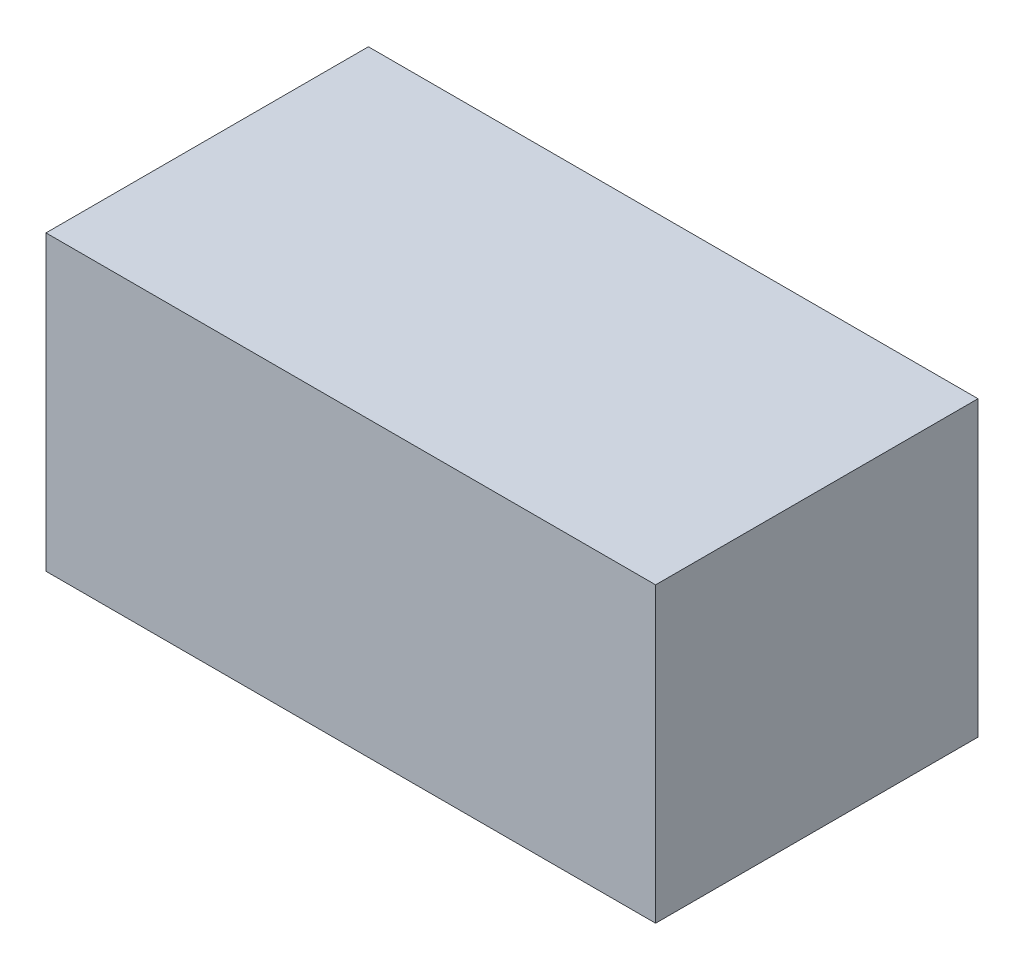
ISO-10303-21;
HEADER;
FILE_DESCRIPTION(('STEP AP214'),'2;1');
FILE_NAME('part.step','',(''),(''),'','','');
FILE_SCHEMA(('AUTOMOTIVE_DESIGN { 1 0 10303 214 1 1 1 1 }'));
ENDSEC;
DATA;
#1=APPLICATION_CONTEXT('core data for automotive mechanical design processes');
#2=APPLICATION_PROTOCOL_DEFINITION('international standard','automotive_design',2000,#1);
#3=PRODUCT_CONTEXT('',#1,'mechanical');
#4=PRODUCT('Part','Part','',(#3));
#5=PRODUCT_RELATED_PRODUCT_CATEGORY('part','',(#4));
#6=PRODUCT_DEFINITION_FORMATION('','',#4);
#7=PRODUCT_DEFINITION_CONTEXT('part definition',#1,'design');
#8=PRODUCT_DEFINITION('design','',#6,#7);
#9=PRODUCT_DEFINITION_SHAPE('','',#8);
#10=(LENGTH_UNIT() NAMED_UNIT(*) SI_UNIT(.MILLI.,.METRE.));
#11=(NAMED_UNIT(*) PLANE_ANGLE_UNIT() SI_UNIT($,.RADIAN.));
#12=(NAMED_UNIT(*) SI_UNIT($,.STERADIAN.) SOLID_ANGLE_UNIT());
#13=UNCERTAINTY_MEASURE_WITH_UNIT(LENGTH_MEASURE(1.E-05),#10,'distance_accuracy_value','');
#14=(GEOMETRIC_REPRESENTATION_CONTEXT(3) GLOBAL_UNCERTAINTY_ASSIGNED_CONTEXT((#13)) GLOBAL_UNIT_ASSIGNED_CONTEXT((#10,
#11,#12)) REPRESENTATION_CONTEXT('',''));
#15=CARTESIAN_POINT('',(0.,0.,0.));
#16=DIRECTION('',(0.,0.,1.));
#17=DIRECTION('',(1.,0.,0.));
#18=AXIS2_PLACEMENT_3D('',#15,#16,#17);
#19=CARTESIAN_POINT('',(8.128,-4.064,13.97));
#20=DIRECTION('',(0.,0.,-1.));
#21=DIRECTION('',(-1.,0.,0.));
#22=AXIS2_PLACEMENT_3D('',#19,#20,#21);
#23=PLANE('',#22);
#24=DIRECTION('',(0.,1.,0.));
#25=VECTOR('',#24,1.);
#26=CARTESIAN_POINT('',(-5.08,-10.414,13.97));
#27=LINE('',#26,#25);
#28=CARTESIAN_POINT('',(-5.08,-10.414,13.97));
#29=VERTEX_POINT('',#28);
#30=CARTESIAN_POINT('',(-5.08,2.286,13.97));
#31=VERTEX_POINT('',#30);
#32=EDGE_CURVE('E27',#29,#31,#27,.T.);
#33=ORIENTED_EDGE('',*,*,#32,.F.);
#34=DIRECTION('',(-1.,0.,0.));
#35=VECTOR('',#34,1.);
#36=CARTESIAN_POINT('',(21.336,-10.414,13.97));
#37=LINE('',#36,#35);
#38=CARTESIAN_POINT('',(21.336,-10.414,13.97));
#39=VERTEX_POINT('',#38);
#40=EDGE_CURVE('E63',#39,#29,#37,.T.);
#41=ORIENTED_EDGE('',*,*,#40,.F.);
#42=DIRECTION('',(0.,-1.,0.));
#43=VECTOR('',#42,1.);
#44=CARTESIAN_POINT('',(21.336,2.286,13.97));
#45=LINE('',#44,#43);
#46=CARTESIAN_POINT('',(21.336,2.286,13.97));
#47=VERTEX_POINT('',#46);
#48=EDGE_CURVE('E91',#47,#39,#45,.T.);
#49=ORIENTED_EDGE('',*,*,#48,.F.);
#50=DIRECTION('',(1.,0.,0.));
#51=VECTOR('',#50,1.);
#52=CARTESIAN_POINT('',(-5.08,2.286,13.97));
#53=LINE('',#52,#51);
#54=EDGE_CURVE('E107',#31,#47,#53,.T.);
#55=ORIENTED_EDGE('',*,*,#54,.F.);
#56=EDGE_LOOP('',(#33,#41,#49,#55));
#57=FACE_BOUND('',#56,.T.);
#58=ADVANCED_FACE('F16',(#57),#23,.F.);
#59=CARTESIAN_POINT('',(8.128,-4.064,0.));
#60=DIRECTION('',(0.,0.,-1.));
#61=DIRECTION('',(-1.,0.,0.));
#62=AXIS2_PLACEMENT_3D('',#59,#60,#61);
#63=PLANE('',#62);
#64=DIRECTION('',(1.,0.,0.));
#65=VECTOR('',#64,1.);
#66=CARTESIAN_POINT('',(-5.08,2.286,0.));
#67=LINE('',#66,#65);
#68=CARTESIAN_POINT('',(-5.08,2.286,0.));
#69=VERTEX_POINT('',#68);
#70=CARTESIAN_POINT('',(21.336,2.286,0.));
#71=VERTEX_POINT('',#70);
#72=EDGE_CURVE('E84',#69,#71,#67,.T.);
#73=ORIENTED_EDGE('',*,*,#72,.T.);
#74=DIRECTION('',(0.,-1.,0.));
#75=VECTOR('',#74,1.);
#76=CARTESIAN_POINT('',(21.336,2.286,0.));
#77=LINE('',#76,#75);
#78=CARTESIAN_POINT('',(21.336,-10.414,0.));
#79=VERTEX_POINT('',#78);
#80=EDGE_CURVE('E81',#71,#79,#77,.T.);
#81=ORIENTED_EDGE('',*,*,#80,.T.);
#82=DIRECTION('',(-1.,0.,0.));
#83=VECTOR('',#82,1.);
#84=CARTESIAN_POINT('',(21.336,-10.414,0.));
#85=LINE('',#84,#83);
#86=CARTESIAN_POINT('',(-5.08,-10.414,0.));
#87=VERTEX_POINT('',#86);
#88=EDGE_CURVE('E70',#79,#87,#85,.T.);
#89=ORIENTED_EDGE('',*,*,#88,.T.);
#90=DIRECTION('',(0.,1.,0.));
#91=VECTOR('',#90,1.);
#92=CARTESIAN_POINT('',(-5.08,-10.414,0.));
#93=LINE('',#92,#91);
#94=EDGE_CURVE('E11',#87,#69,#93,.T.);
#95=ORIENTED_EDGE('',*,*,#94,.T.);
#96=EDGE_LOOP('',(#73,#81,#89,#95));
#97=FACE_BOUND('',#96,.T.);
#98=ADVANCED_FACE('F82',(#97),#63,.T.);
#99=CARTESIAN_POINT('',(-5.08,-10.414,0.));
#100=DIRECTION('',(-1.,0.,0.));
#101=DIRECTION('',(0.,0.,1.));
#102=AXIS2_PLACEMENT_3D('',#99,#100,#101);
#103=PLANE('',#102);
#104=DIRECTION('',(0.,0.,1.));
#105=VECTOR('',#104,1.);
#106=CARTESIAN_POINT('',(-5.08,-10.414,0.));
#107=LINE('',#106,#105);
#108=EDGE_CURVE('E76',#87,#29,#107,.T.);
#109=ORIENTED_EDGE('',*,*,#108,.T.);
#110=ORIENTED_EDGE('',*,*,#32,.T.);
#111=DIRECTION('',(0.,0.,1.));
#112=VECTOR('',#111,1.);
#113=CARTESIAN_POINT('',(-5.08,2.286,0.));
#114=LINE('',#113,#112);
#115=EDGE_CURVE('E20',#69,#31,#114,.T.);
#116=ORIENTED_EDGE('',*,*,#115,.F.);
#117=ORIENTED_EDGE('',*,*,#94,.F.);
#118=EDGE_LOOP('',(#109,#110,#116,#117));
#119=FACE_BOUND('',#118,.T.);
#120=ADVANCED_FACE('F121',(#119),#103,.T.);
#121=CARTESIAN_POINT('',(21.336,-10.414,0.));
#122=DIRECTION('',(0.,-1.,0.));
#123=DIRECTION('',(0.,0.,-1.));
#124=AXIS2_PLACEMENT_3D('',#121,#122,#123);
#125=PLANE('',#124);
#126=DIRECTION('',(0.,0.,1.));
#127=VECTOR('',#126,1.);
#128=CARTESIAN_POINT('',(21.336,-10.414,0.));
#129=LINE('',#128,#127);
#130=EDGE_CURVE('E74',#79,#39,#129,.T.);
#131=ORIENTED_EDGE('',*,*,#130,.T.);
#132=ORIENTED_EDGE('',*,*,#40,.T.);
#133=ORIENTED_EDGE('',*,*,#108,.F.);
#134=ORIENTED_EDGE('',*,*,#88,.F.);
#135=EDGE_LOOP('',(#131,#132,#133,#134));
#136=FACE_BOUND('',#135,.T.);
#137=ADVANCED_FACE('F72',(#136),#125,.T.);
#138=CARTESIAN_POINT('',(21.336,2.286,0.));
#139=DIRECTION('',(1.,0.,0.));
#140=DIRECTION('',(0.,1.,0.));
#141=AXIS2_PLACEMENT_3D('',#138,#139,#140);
#142=PLANE('',#141);
#143=DIRECTION('',(0.,0.,1.));
#144=VECTOR('',#143,1.);
#145=CARTESIAN_POINT('',(21.336,2.286,0.));
#146=LINE('',#145,#144);
#147=EDGE_CURVE('E101',#71,#47,#146,.T.);
#148=ORIENTED_EDGE('',*,*,#147,.T.);
#149=ORIENTED_EDGE('',*,*,#48,.T.);
#150=ORIENTED_EDGE('',*,*,#130,.F.);
#151=ORIENTED_EDGE('',*,*,#80,.F.);
#152=EDGE_LOOP('',(#148,#149,#150,#151));
#153=FACE_BOUND('',#152,.T.);
#154=ADVANCED_FACE('F90',(#153),#142,.T.);
#155=CARTESIAN_POINT('',(-5.08,2.286,0.));
#156=DIRECTION('',(0.,1.,0.));
#157=DIRECTION('',(1.,0.,0.));
#158=AXIS2_PLACEMENT_3D('',#155,#156,#157);
#159=PLANE('',#158);
#160=ORIENTED_EDGE('',*,*,#115,.T.);
#161=ORIENTED_EDGE('',*,*,#54,.T.);
#162=ORIENTED_EDGE('',*,*,#147,.F.);
#163=ORIENTED_EDGE('',*,*,#72,.F.);
#164=EDGE_LOOP('',(#160,#161,#162,#163));
#165=FACE_BOUND('',#164,.T.);
#166=ADVANCED_FACE('F18',(#165),#159,.T.);
#167=CLOSED_SHELL('',(#58,#98,#120,#137,#154,#166));
#168=MANIFOLD_SOLID_BREP('B1',#167);
#169=ADVANCED_BREP_SHAPE_REPRESENTATION('',(#18,#168),#14);
#170=SHAPE_DEFINITION_REPRESENTATION(#9,#169);
ENDSEC;
END-ISO-10303-21;
